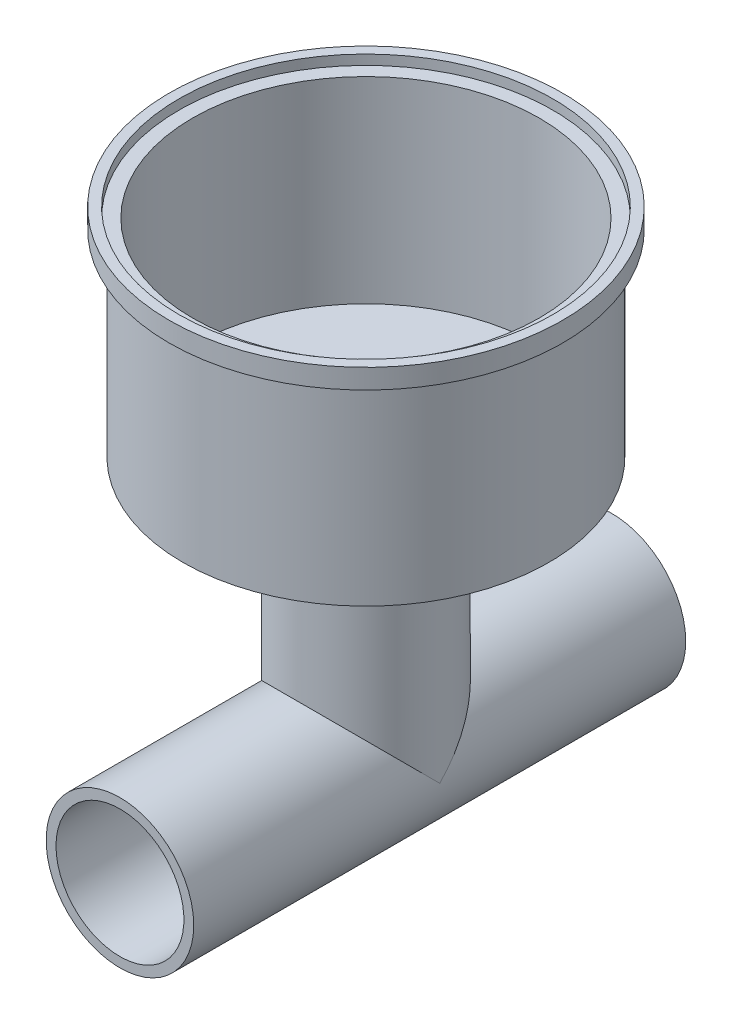
ISO-10303-21;
HEADER;
FILE_DESCRIPTION(('STEP AP214'),'2;1');
FILE_NAME('part.step','',(''),(''),'','','');
FILE_SCHEMA(('AUTOMOTIVE_DESIGN { 1 0 10303 214 1 1 1 1 }'));
ENDSEC;
DATA;
#1=APPLICATION_CONTEXT('core data for automotive mechanical design processes');
#2=APPLICATION_PROTOCOL_DEFINITION('international standard','automotive_design',2000,#1);
#3=PRODUCT_CONTEXT('',#1,'mechanical');
#4=PRODUCT('Part','Part','',(#3));
#5=PRODUCT_RELATED_PRODUCT_CATEGORY('part','',(#4));
#6=PRODUCT_DEFINITION_FORMATION('','',#4);
#7=PRODUCT_DEFINITION_CONTEXT('part definition',#1,'design');
#8=PRODUCT_DEFINITION('design','',#6,#7);
#9=PRODUCT_DEFINITION_SHAPE('','',#8);
#10=(LENGTH_UNIT() NAMED_UNIT(*) SI_UNIT(.MILLI.,.METRE.));
#11=(NAMED_UNIT(*) PLANE_ANGLE_UNIT() SI_UNIT($,.RADIAN.));
#12=(NAMED_UNIT(*) SI_UNIT($,.STERADIAN.) SOLID_ANGLE_UNIT());
#13=UNCERTAINTY_MEASURE_WITH_UNIT(LENGTH_MEASURE(1.E-05),#10,'distance_accuracy_value','');
#14=(GEOMETRIC_REPRESENTATION_CONTEXT(3) GLOBAL_UNCERTAINTY_ASSIGNED_CONTEXT((#13)) GLOBAL_UNIT_ASSIGNED_CONTEXT((#10,
#11,#12)) REPRESENTATION_CONTEXT('',''));
#15=CARTESIAN_POINT('',(0.,0.,0.));
#16=DIRECTION('',(0.,0.,1.));
#17=DIRECTION('',(1.,0.,0.));
#18=AXIS2_PLACEMENT_3D('',#15,#16,#17);
#19=CARTESIAN_POINT('',(0.,0.,25.));
#20=DIRECTION('',(0.,0.,-1.));
#21=DIRECTION('',(-1.,0.,0.));
#22=AXIS2_PLACEMENT_3D('',#19,#20,#21);
#23=CYLINDRICAL_SURFACE('',#22,7.5);
#24=CARTESIAN_POINT('',(0.,0.,-25.));
#25=DIRECTION('',(0.,0.,1.));
#26=DIRECTION('',(1.,0.,0.));
#27=AXIS2_PLACEMENT_3D('',#24,#25,#26);
#28=CIRCLE('',#27,7.5);
#29=CARTESIAN_POINT('',(7.5,0.,-25.));
#30=VERTEX_POINT('',#29);
#31=EDGE_CURVE('E96',#30,#30,#28,.T.);
#32=ORIENTED_EDGE('',*,*,#31,.T.);
#33=EDGE_LOOP('',(#32));
#34=FACE_BOUND('',#33,.T.);
#35=CARTESIAN_POINT('',(0.,0.,25.));
#36=DIRECTION('',(0.,0.,1.));
#37=DIRECTION('',(1.,0.,0.));
#38=AXIS2_PLACEMENT_3D('',#35,#36,#37);
#39=CIRCLE('',#38,7.5);
#40=CARTESIAN_POINT('',(7.5,0.,25.));
#41=VERTEX_POINT('',#40);
#42=EDGE_CURVE('E97',#41,#41,#39,.T.);
#43=ORIENTED_EDGE('',*,*,#42,.F.);
#44=EDGE_LOOP('',(#43));
#45=FACE_BOUND('',#44,.T.);
#46=CARTESIAN_POINT('',(0.,0.,0.));
#47=DIRECTION('',(0.,-0.707106781186547,-0.707106781186547));
#48=DIRECTION('',(0.,0.707106781186547,-0.707106781186547));
#49=AXIS2_PLACEMENT_3D('',#46,#47,#48);
#50=ELLIPSE('',#49,10.6066017177982,7.5);
#51=CARTESIAN_POINT('',(7.5,0.,0.));
#52=VERTEX_POINT('',#51);
#53=CARTESIAN_POINT('',(-7.5,0.,0.));
#54=VERTEX_POINT('',#53);
#55=EDGE_CURVE('E11',#52,#54,#50,.F.);
#56=ORIENTED_EDGE('',*,*,#55,.F.);
#57=CARTESIAN_POINT('',(0.,0.,0.));
#58=DIRECTION('',(0.,0.707106781186547,-0.707106781186547));
#59=DIRECTION('',(0.,-0.707106781186547,-0.707106781186547));
#60=AXIS2_PLACEMENT_3D('',#57,#58,#59);
#61=ELLIPSE('',#60,10.6066017177982,7.5);
#62=EDGE_CURVE('E40',#54,#52,#61,.T.);
#63=ORIENTED_EDGE('',*,*,#62,.F.);
#64=EDGE_LOOP('',(#56,#63));
#65=FACE_BOUND('',#64,.T.);
#66=ADVANCED_FACE('F33',(#34,#45,#65),#23,.T.);
#67=CARTESIAN_POINT('',(0.,0.,25.));
#68=DIRECTION('',(0.,0.,1.));
#69=DIRECTION('',(1.,0.,0.));
#70=AXIS2_PLACEMENT_3D('',#67,#68,#69);
#71=PLANE('',#70);
#72=CARTESIAN_POINT('',(0.,0.,25.));
#73=DIRECTION('',(0.,0.,-1.));
#74=DIRECTION('',(-1.,0.,0.));
#75=AXIS2_PLACEMENT_3D('',#72,#73,#74);
#76=CIRCLE('',#75,6.5);
#77=CARTESIAN_POINT('',(-6.5,0.,25.));
#78=VERTEX_POINT('',#77);
#79=EDGE_CURVE('E79',#78,#78,#76,.T.);
#80=ORIENTED_EDGE('',*,*,#79,.T.);
#81=EDGE_LOOP('',(#80));
#82=FACE_BOUND('',#81,.T.);
#83=ORIENTED_EDGE('',*,*,#42,.T.);
#84=EDGE_LOOP('',(#83));
#85=FACE_BOUND('',#84,.T.);
#86=ADVANCED_FACE('F115',(#82,#85),#71,.T.);
#87=CARTESIAN_POINT('',(0.,0.,-25.));
#88=DIRECTION('',(0.,0.,1.));
#89=DIRECTION('',(1.,0.,0.));
#90=AXIS2_PLACEMENT_3D('',#87,#88,#89);
#91=PLANE('',#90);
#92=CARTESIAN_POINT('',(0.,0.,-25.));
#93=DIRECTION('',(0.,0.,-1.));
#94=DIRECTION('',(-1.,0.,0.));
#95=AXIS2_PLACEMENT_3D('',#92,#93,#94);
#96=CIRCLE('',#95,6.5);
#97=CARTESIAN_POINT('',(-6.5,0.,-25.));
#98=VERTEX_POINT('',#97);
#99=EDGE_CURVE('E135',#98,#98,#96,.T.);
#100=ORIENTED_EDGE('',*,*,#99,.F.);
#101=EDGE_LOOP('',(#100));
#102=FACE_BOUND('',#101,.T.);
#103=ORIENTED_EDGE('',*,*,#31,.F.);
#104=EDGE_LOOP('',(#103));
#105=FACE_BOUND('',#104,.T.);
#106=ADVANCED_FACE('F105',(#102,#105),#91,.F.);
#107=CARTESIAN_POINT('',(0.,25.,0.));
#108=DIRECTION('',(0.,-1.,0.));
#109=DIRECTION('',(0.,0.,-1.));
#110=AXIS2_PLACEMENT_3D('',#107,#108,#109);
#111=CYLINDRICAL_SURFACE('',#110,7.5);
#112=CARTESIAN_POINT('',(0.,25.,0.));
#113=DIRECTION('',(0.,1.,0.));
#114=DIRECTION('',(0.,0.,1.));
#115=AXIS2_PLACEMENT_3D('',#112,#113,#114);
#116=CIRCLE('',#115,7.5);
#117=CARTESIAN_POINT('',(0.,25.,7.5));
#118=VERTEX_POINT('',#117);
#119=EDGE_CURVE('E91',#118,#118,#116,.T.);
#120=ORIENTED_EDGE('',*,*,#119,.F.);
#121=EDGE_LOOP('',(#120));
#122=FACE_BOUND('',#121,.T.);
#123=ORIENTED_EDGE('',*,*,#62,.T.);
#124=ORIENTED_EDGE('',*,*,#55,.T.);
#125=EDGE_LOOP('',(#123,#124));
#126=FACE_BOUND('',#125,.T.);
#127=ADVANCED_FACE('F102',(#122,#126),#111,.T.);
#128=CARTESIAN_POINT('',(0.,45.,0.));
#129=DIRECTION('',(0.,-1.,0.));
#130=DIRECTION('',(0.,0.,-1.));
#131=AXIS2_PLACEMENT_3D('',#128,#129,#130);
#132=CYLINDRICAL_SURFACE('',#131,18.6138896398219);
#133=CARTESIAN_POINT('',(0.,45.,0.));
#134=DIRECTION('',(0.,1.,0.));
#135=DIRECTION('',(0.,0.,1.));
#136=AXIS2_PLACEMENT_3D('',#133,#134,#135);
#137=CIRCLE('',#136,18.6138896398219);
#138=CARTESIAN_POINT('',(0.,45.,18.6138896398219));
#139=VERTEX_POINT('',#138);
#140=EDGE_CURVE('E88',#139,#139,#137,.T.);
#141=ORIENTED_EDGE('',*,*,#140,.F.);
#142=EDGE_LOOP('',(#141));
#143=FACE_BOUND('',#142,.T.);
#144=CARTESIAN_POINT('',(0.,25.,0.));
#145=DIRECTION('',(0.,1.,0.));
#146=DIRECTION('',(0.,0.,1.));
#147=AXIS2_PLACEMENT_3D('',#144,#145,#146);
#148=CIRCLE('',#147,18.6138896398219);
#149=CARTESIAN_POINT('',(0.,25.,18.6138896398219));
#150=VERTEX_POINT('',#149);
#151=EDGE_CURVE('E85',#150,#150,#148,.T.);
#152=ORIENTED_EDGE('',*,*,#151,.T.);
#153=EDGE_LOOP('',(#152));
#154=FACE_BOUND('',#153,.T.);
#155=ADVANCED_FACE('F104',(#143,#154),#132,.T.);
#156=CARTESIAN_POINT('',(0.,25.,0.));
#157=DIRECTION('',(0.,1.,0.));
#158=DIRECTION('',(0.,0.,1.));
#159=AXIS2_PLACEMENT_3D('',#156,#157,#158);
#160=PLANE('',#159);
#161=ORIENTED_EDGE('',*,*,#119,.T.);
#162=EDGE_LOOP('',(#161));
#163=FACE_BOUND('',#162,.T.);
#164=ORIENTED_EDGE('',*,*,#151,.F.);
#165=EDGE_LOOP('',(#164));
#166=FACE_BOUND('',#165,.T.);
#167=ADVANCED_FACE('F112',(#163,#166),#160,.F.);
#168=CARTESIAN_POINT('',(0.,47.,0.));
#169=DIRECTION('',(0.,-1.,0.));
#170=DIRECTION('',(0.,0.,-1.));
#171=AXIS2_PLACEMENT_3D('',#168,#169,#170);
#172=CYLINDRICAL_SURFACE('',#171,20.);
#173=CARTESIAN_POINT('',(0.,47.,0.));
#174=DIRECTION('',(0.,1.,0.));
#175=DIRECTION('',(0.,0.,1.));
#176=AXIS2_PLACEMENT_3D('',#173,#174,#175);
#177=CIRCLE('',#176,20.);
#178=CARTESIAN_POINT('',(0.,47.,20.));
#179=VERTEX_POINT('',#178);
#180=EDGE_CURVE('E82',#179,#179,#177,.T.);
#181=ORIENTED_EDGE('',*,*,#180,.F.);
#182=EDGE_LOOP('',(#181));
#183=FACE_BOUND('',#182,.T.);
#184=CARTESIAN_POINT('',(0.,45.,0.));
#185=DIRECTION('',(0.,1.,0.));
#186=DIRECTION('',(0.,0.,1.));
#187=AXIS2_PLACEMENT_3D('',#184,#185,#186);
#188=CIRCLE('',#187,20.);
#189=CARTESIAN_POINT('',(0.,45.,20.));
#190=VERTEX_POINT('',#189);
#191=EDGE_CURVE('E59',#190,#190,#188,.T.);
#192=ORIENTED_EDGE('',*,*,#191,.T.);
#193=EDGE_LOOP('',(#192));
#194=FACE_BOUND('',#193,.T.);
#195=ADVANCED_FACE('F169',(#183,#194),#172,.T.);
#196=CARTESIAN_POINT('',(0.,47.,0.));
#197=DIRECTION('',(0.,1.,0.));
#198=DIRECTION('',(0.,0.,1.));
#199=AXIS2_PLACEMENT_3D('',#196,#197,#198);
#200=PLANE('',#199);
#201=CARTESIAN_POINT('',(0.,47.,0.));
#202=DIRECTION('',(0.,1.,0.));
#203=DIRECTION('',(0.,0.,1.));
#204=AXIS2_PLACEMENT_3D('',#201,#202,#203);
#205=CIRCLE('',#204,19.);
#206=CARTESIAN_POINT('',(0.,47.,19.));
#207=VERTEX_POINT('',#206);
#208=EDGE_CURVE('E73',#207,#207,#205,.T.);
#209=ORIENTED_EDGE('',*,*,#208,.F.);
#210=EDGE_LOOP('',(#209));
#211=FACE_BOUND('',#210,.T.);
#212=ORIENTED_EDGE('',*,*,#180,.T.);
#213=EDGE_LOOP('',(#212));
#214=FACE_BOUND('',#213,.T.);
#215=ADVANCED_FACE('F149',(#211,#214),#200,.T.);
#216=CARTESIAN_POINT('',(0.,45.,0.));
#217=DIRECTION('',(0.,1.,0.));
#218=DIRECTION('',(0.,0.,1.));
#219=AXIS2_PLACEMENT_3D('',#216,#217,#218);
#220=PLANE('',#219);
#221=ORIENTED_EDGE('',*,*,#140,.T.);
#222=EDGE_LOOP('',(#221));
#223=FACE_BOUND('',#222,.T.);
#224=ORIENTED_EDGE('',*,*,#191,.F.);
#225=EDGE_LOOP('',(#224));
#226=FACE_BOUND('',#225,.T.);
#227=ADVANCED_FACE('F140',(#223,#226),#220,.F.);
#228=CARTESIAN_POINT('',(0.,0.,25.));
#229=DIRECTION('',(0.,0.,-1.));
#230=DIRECTION('',(-1.,0.,0.));
#231=AXIS2_PLACEMENT_3D('',#228,#229,#230);
#232=CYLINDRICAL_SURFACE('',#231,6.5);
#233=CARTESIAN_POINT('',(0.,0.,0.));
#234=DIRECTION('',(0.,-0.707106781186547,-0.707106781186547));
#235=DIRECTION('',(0.,0.707106781186547,-0.707106781186547));
#236=AXIS2_PLACEMENT_3D('',#233,#234,#235);
#237=ELLIPSE('',#236,9.19238815542511,6.5);
#238=CARTESIAN_POINT('',(6.5,0.,0.));
#239=VERTEX_POINT('',#238);
#240=CARTESIAN_POINT('',(-6.5,0.,0.));
#241=VERTEX_POINT('',#240);
#242=EDGE_CURVE('E54',#239,#241,#237,.F.);
#243=ORIENTED_EDGE('',*,*,#242,.T.);
#244=CARTESIAN_POINT('',(0.,0.,0.));
#245=DIRECTION('',(0.,0.707106781186547,-0.707106781186547));
#246=DIRECTION('',(0.,-0.707106781186547,-0.707106781186547));
#247=AXIS2_PLACEMENT_3D('',#244,#245,#246);
#248=ELLIPSE('',#247,9.19238815542511,6.5);
#249=EDGE_CURVE('E57',#241,#239,#248,.T.);
#250=ORIENTED_EDGE('',*,*,#249,.T.);
#251=EDGE_LOOP('',(#243,#250));
#252=FACE_BOUND('',#251,.T.);
#253=ORIENTED_EDGE('',*,*,#99,.T.);
#254=EDGE_LOOP('',(#253));
#255=FACE_BOUND('',#254,.T.);
#256=ORIENTED_EDGE('',*,*,#79,.F.);
#257=EDGE_LOOP('',(#256));
#258=FACE_BOUND('',#257,.T.);
#259=ADVANCED_FACE('F61',(#252,#255,#258),#232,.F.);
#260=CARTESIAN_POINT('',(0.,25.,0.));
#261=DIRECTION('',(0.,-1.,0.));
#262=DIRECTION('',(0.,0.,-1.));
#263=AXIS2_PLACEMENT_3D('',#260,#261,#262);
#264=CYLINDRICAL_SURFACE('',#263,6.5);
#265=CARTESIAN_POINT('',(0.,26.,0.));
#266=DIRECTION('',(0.,1.,0.));
#267=DIRECTION('',(0.,0.,1.));
#268=AXIS2_PLACEMENT_3D('',#265,#266,#267);
#269=CIRCLE('',#268,6.5);
#270=CARTESIAN_POINT('',(0.,26.,6.5));
#271=VERTEX_POINT('',#270);
#272=EDGE_CURVE('E63',#271,#271,#269,.T.);
#273=ORIENTED_EDGE('',*,*,#272,.T.);
#274=EDGE_LOOP('',(#273));
#275=FACE_BOUND('',#274,.T.);
#276=ORIENTED_EDGE('',*,*,#249,.F.);
#277=ORIENTED_EDGE('',*,*,#242,.F.);
#278=EDGE_LOOP('',(#276,#277));
#279=FACE_BOUND('',#278,.T.);
#280=ADVANCED_FACE('F56',(#275,#279),#264,.F.);
#281=CARTESIAN_POINT('',(0.,45.,0.));
#282=DIRECTION('',(0.,-1.,0.));
#283=DIRECTION('',(0.,0.,-1.));
#284=AXIS2_PLACEMENT_3D('',#281,#282,#283);
#285=CYLINDRICAL_SURFACE('',#284,17.6138896398219);
#286=CARTESIAN_POINT('',(0.,46.,0.));
#287=DIRECTION('',(0.,1.,0.));
#288=DIRECTION('',(0.,0.,1.));
#289=AXIS2_PLACEMENT_3D('',#286,#287,#288);
#290=CIRCLE('',#289,17.6138896398219);
#291=CARTESIAN_POINT('',(0.,46.,17.6138896398219));
#292=VERTEX_POINT('',#291);
#293=EDGE_CURVE('E66',#292,#292,#290,.T.);
#294=ORIENTED_EDGE('',*,*,#293,.T.);
#295=EDGE_LOOP('',(#294));
#296=FACE_BOUND('',#295,.T.);
#297=CARTESIAN_POINT('',(0.,26.,0.));
#298=DIRECTION('',(0.,1.,0.));
#299=DIRECTION('',(0.,0.,1.));
#300=AXIS2_PLACEMENT_3D('',#297,#298,#299);
#301=CIRCLE('',#300,17.6138896398219);
#302=CARTESIAN_POINT('',(0.,26.,17.6138896398219));
#303=VERTEX_POINT('',#302);
#304=EDGE_CURVE('E70',#303,#303,#301,.T.);
#305=ORIENTED_EDGE('',*,*,#304,.F.);
#306=EDGE_LOOP('',(#305));
#307=FACE_BOUND('',#306,.T.);
#308=ADVANCED_FACE('F146',(#296,#307),#285,.F.);
#309=CARTESIAN_POINT('',(0.,26.,0.));
#310=DIRECTION('',(0.,1.,0.));
#311=DIRECTION('',(0.,0.,1.));
#312=AXIS2_PLACEMENT_3D('',#309,#310,#311);
#313=PLANE('',#312);
#314=ORIENTED_EDGE('',*,*,#272,.F.);
#315=EDGE_LOOP('',(#314));
#316=FACE_BOUND('',#315,.T.);
#317=ORIENTED_EDGE('',*,*,#304,.T.);
#318=EDGE_LOOP('',(#317));
#319=FACE_BOUND('',#318,.T.);
#320=ADVANCED_FACE('F155',(#316,#319),#313,.T.);
#321=CARTESIAN_POINT('',(0.,47.,0.));
#322=DIRECTION('',(0.,-1.,0.));
#323=DIRECTION('',(0.,0.,-1.));
#324=AXIS2_PLACEMENT_3D('',#321,#322,#323);
#325=CYLINDRICAL_SURFACE('',#324,19.);
#326=ORIENTED_EDGE('',*,*,#208,.T.);
#327=EDGE_LOOP('',(#326));
#328=FACE_BOUND('',#327,.T.);
#329=CARTESIAN_POINT('',(0.,46.,0.));
#330=DIRECTION('',(0.,1.,0.));
#331=DIRECTION('',(0.,0.,1.));
#332=AXIS2_PLACEMENT_3D('',#329,#330,#331);
#333=CIRCLE('',#332,19.);
#334=CARTESIAN_POINT('',(0.,46.,19.));
#335=VERTEX_POINT('',#334);
#336=EDGE_CURVE('E76',#335,#335,#333,.T.);
#337=ORIENTED_EDGE('',*,*,#336,.F.);
#338=EDGE_LOOP('',(#337));
#339=FACE_BOUND('',#338,.T.);
#340=ADVANCED_FACE('F159',(#328,#339),#325,.F.);
#341=CARTESIAN_POINT('',(0.,46.,0.));
#342=DIRECTION('',(0.,1.,0.));
#343=DIRECTION('',(0.,0.,1.));
#344=AXIS2_PLACEMENT_3D('',#341,#342,#343);
#345=PLANE('',#344);
#346=ORIENTED_EDGE('',*,*,#293,.F.);
#347=EDGE_LOOP('',(#346));
#348=FACE_BOUND('',#347,.T.);
#349=ORIENTED_EDGE('',*,*,#336,.T.);
#350=EDGE_LOOP('',(#349));
#351=FACE_BOUND('',#350,.T.);
#352=ADVANCED_FACE('F163',(#348,#351),#345,.T.);
#353=CLOSED_SHELL('',(#66,#86,#106,#127,#155,#167,#195,#215,#227,#259,#280,#308,#320,#340,#352));
#354=MANIFOLD_SOLID_BREP('B2',#353);
#355=ADVANCED_BREP_SHAPE_REPRESENTATION('',(#18,#354),#14);
#356=SHAPE_DEFINITION_REPRESENTATION(#9,#355);
ENDSEC;
END-ISO-10303-21;
